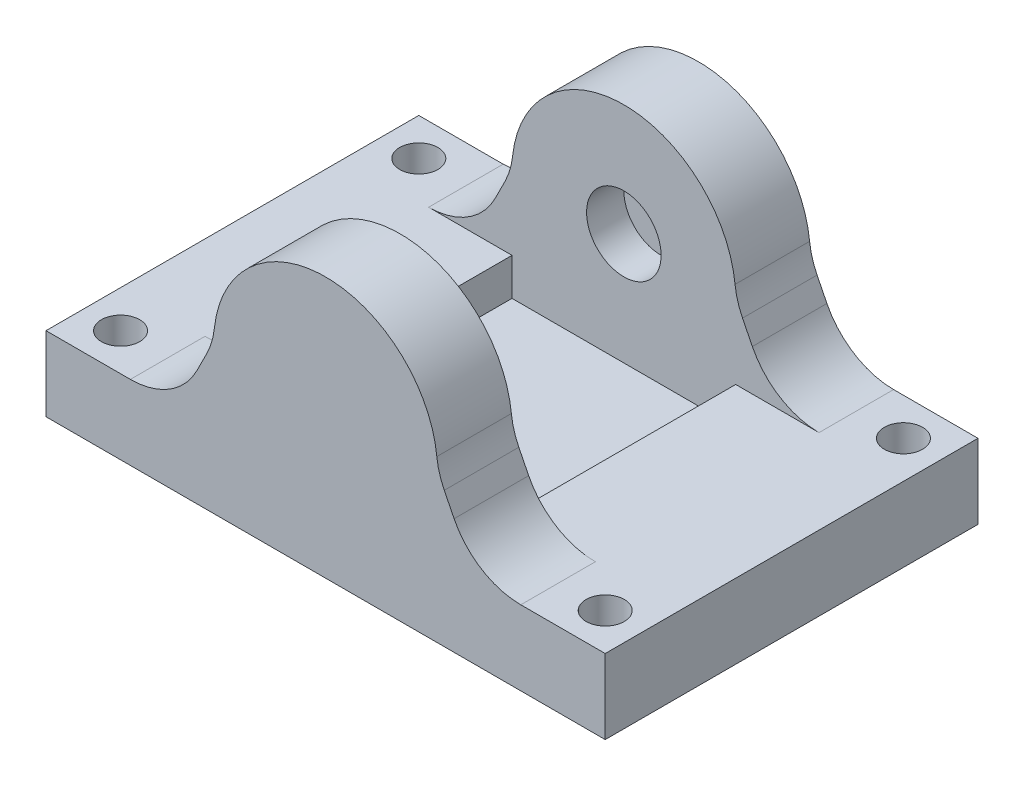
ISO-10303-21;
HEADER;
FILE_DESCRIPTION(('STEP AP214'),'2;1');
FILE_NAME('part.step','',(''),(''),'','','');
FILE_SCHEMA(('AUTOMOTIVE_DESIGN { 1 0 10303 214 1 1 1 1 }'));
ENDSEC;
DATA;
#1=APPLICATION_CONTEXT('core data for automotive mechanical design processes');
#2=APPLICATION_PROTOCOL_DEFINITION('international standard','automotive_design',2000,#1);
#3=PRODUCT_CONTEXT('',#1,'mechanical');
#4=PRODUCT('Part','Part','',(#3));
#5=PRODUCT_RELATED_PRODUCT_CATEGORY('part','',(#4));
#6=PRODUCT_DEFINITION_FORMATION('','',#4);
#7=PRODUCT_DEFINITION_CONTEXT('part definition',#1,'design');
#8=PRODUCT_DEFINITION('design','',#6,#7);
#9=PRODUCT_DEFINITION_SHAPE('','',#8);
#10=(LENGTH_UNIT() NAMED_UNIT(*) SI_UNIT(.MILLI.,.METRE.));
#11=(NAMED_UNIT(*) PLANE_ANGLE_UNIT() SI_UNIT($,.RADIAN.));
#12=(NAMED_UNIT(*) SI_UNIT($,.STERADIAN.) SOLID_ANGLE_UNIT());
#13=UNCERTAINTY_MEASURE_WITH_UNIT(LENGTH_MEASURE(1.E-05),#10,'distance_accuracy_value','');
#14=(GEOMETRIC_REPRESENTATION_CONTEXT(3) GLOBAL_UNCERTAINTY_ASSIGNED_CONTEXT((#13)) GLOBAL_UNIT_ASSIGNED_CONTEXT((#10,
#11,#12)) REPRESENTATION_CONTEXT('',''));
#15=CARTESIAN_POINT('',(0.,0.,0.));
#16=DIRECTION('',(0.,0.,1.));
#17=DIRECTION('',(1.,0.,0.));
#18=AXIS2_PLACEMENT_3D('',#15,#16,#17);
#19=CARTESIAN_POINT('',(0.,10.,0.));
#20=DIRECTION('',(0.,1.,0.));
#21=DIRECTION('',(0.,0.,1.));
#22=AXIS2_PLACEMENT_3D('',#19,#20,#21);
#23=PLANE('',#22);
#24=DIRECTION('',(0.,0.,1.));
#25=VECTOR('',#24,1.);
#26=CARTESIAN_POINT('',(22.5,10.,-40.));
#27=LINE('',#26,#25);
#28=CARTESIAN_POINT('',(22.5,10.,-40.));
#29=VERTEX_POINT('',#28);
#30=CARTESIAN_POINT('',(22.5,10.,-10.));
#31=VERTEX_POINT('',#30);
#32=EDGE_CURVE('E209',#29,#31,#27,.T.);
#33=ORIENTED_EDGE('',*,*,#32,.F.);
#34=DIRECTION('',(1.,0.,0.));
#35=VECTOR('',#34,1.);
#36=CARTESIAN_POINT('',(17.5,10.,-40.));
#37=LINE('',#36,#35);
#38=CARTESIAN_POINT('',(11.319660112501,10.,-40.));
#39=VERTEX_POINT('',#38);
#40=EDGE_CURVE('E280',#39,#29,#37,.T.);
#41=ORIENTED_EDGE('',*,*,#40,.F.);
#42=DIRECTION('',(0.,0.,-1.));
#43=VECTOR('',#42,1.);
#44=CARTESIAN_POINT('',(11.319660112501,10.,0.));
#45=LINE('',#44,#43);
#46=CARTESIAN_POINT('',(11.319660112501,10.,-50.));
#47=VERTEX_POINT('',#46);
#48=EDGE_CURVE('E395',#39,#47,#45,.T.);
#49=ORIENTED_EDGE('',*,*,#48,.T.);
#50=DIRECTION('',(1.,0.,0.));
#51=VECTOR('',#50,1.);
#52=CARTESIAN_POINT('',(0.,10.,-50.));
#53=LINE('',#52,#51);
#54=CARTESIAN_POINT('',(0.,10.,-50.));
#55=VERTEX_POINT('',#54);
#56=EDGE_CURVE('E328',#55,#47,#53,.T.);
#57=ORIENTED_EDGE('',*,*,#56,.F.);
#58=DIRECTION('',(0.,0.,-1.));
#59=VECTOR('',#58,1.);
#60=CARTESIAN_POINT('',(0.,10.,0.));
#61=LINE('',#60,#59);
#62=CARTESIAN_POINT('',(0.,10.,0.));
#63=VERTEX_POINT('',#62);
#64=EDGE_CURVE('E331',#63,#55,#61,.T.);
#65=ORIENTED_EDGE('',*,*,#64,.F.);
#66=DIRECTION('',(1.,0.,0.));
#67=VECTOR('',#66,1.);
#68=CARTESIAN_POINT('',(0.,10.,0.));
#69=LINE('',#68,#67);
#70=CARTESIAN_POINT('',(11.319660112501,10.,0.));
#71=VERTEX_POINT('',#70);
#72=EDGE_CURVE('E320',#63,#71,#69,.T.);
#73=ORIENTED_EDGE('',*,*,#72,.T.);
#74=DIRECTION('',(0.,0.,1.));
#75=VECTOR('',#74,1.);
#76=CARTESIAN_POINT('',(11.319660112501,10.,-10.));
#77=LINE('',#76,#75);
#78=CARTESIAN_POINT('',(11.319660112501,10.,-10.));
#79=VERTEX_POINT('',#78);
#80=EDGE_CURVE('E362',#71,#79,#77,.F.);
#81=ORIENTED_EDGE('',*,*,#80,.T.);
#82=DIRECTION('',(1.,0.,0.));
#83=VECTOR('',#82,1.);
#84=CARTESIAN_POINT('',(17.5,10.,-10.));
#85=LINE('',#84,#83);
#86=EDGE_CURVE('E307',#79,#31,#85,.T.);
#87=ORIENTED_EDGE('',*,*,#86,.T.);
#88=EDGE_LOOP('',(#33,#41,#49,#57,#65,#73,#81,#87));
#89=FACE_BOUND('',#88,.T.);
#90=CARTESIAN_POINT('',(5.,10.,-5.));
#91=DIRECTION('',(0.,1.,0.));
#92=DIRECTION('',(0.,0.,1.));
#93=AXIS2_PLACEMENT_3D('',#90,#91,#92);
#94=CIRCLE('',#93,2.5625);
#95=CARTESIAN_POINT('',(5.,10.,-2.4375));
#96=VERTEX_POINT('',#95);
#97=EDGE_CURVE('E258',#96,#96,#94,.T.);
#98=ORIENTED_EDGE('',*,*,#97,.F.);
#99=EDGE_LOOP('',(#98));
#100=FACE_BOUND('',#99,.T.);
#101=CARTESIAN_POINT('',(5.,10.,-45.));
#102=DIRECTION('',(0.,-1.,0.));
#103=DIRECTION('',(0.,0.,-1.));
#104=AXIS2_PLACEMENT_3D('',#101,#102,#103);
#105=CIRCLE('',#104,2.5625);
#106=CARTESIAN_POINT('',(5.,10.,-47.5625));
#107=VERTEX_POINT('',#106);
#108=EDGE_CURVE('E252',#107,#107,#105,.T.);
#109=ORIENTED_EDGE('',*,*,#108,.T.);
#110=EDGE_LOOP('',(#109));
#111=FACE_BOUND('',#110,.T.);
#112=ADVANCED_FACE('F40',(#89,#100,#111),#23,.T.);
#113=DIRECTION('',(0.,0.,-1.));
#114=VECTOR('',#113,1.);
#115=CARTESIAN_POINT('',(52.5,10.,-40.));
#116=LINE('',#115,#114);
#117=CARTESIAN_POINT('',(52.5,10.,-10.));
#118=VERTEX_POINT('',#117);
#119=CARTESIAN_POINT('',(52.5,10.,-40.));
#120=VERTEX_POINT('',#119);
#121=EDGE_CURVE('E55',#118,#120,#116,.T.);
#122=ORIENTED_EDGE('',*,*,#121,.F.);
#123=CARTESIAN_POINT('',(63.680339887499,10.,-10.));
#124=VERTEX_POINT('',#123);
#125=EDGE_CURVE('E306',#118,#124,#85,.T.);
#126=ORIENTED_EDGE('',*,*,#125,.T.);
#127=DIRECTION('',(0.,0.,1.));
#128=VECTOR('',#127,1.);
#129=CARTESIAN_POINT('',(63.680339887499,10.,0.));
#130=LINE('',#129,#128);
#131=CARTESIAN_POINT('',(63.680339887499,10.,0.));
#132=VERTEX_POINT('',#131);
#133=EDGE_CURVE('E359',#124,#132,#130,.T.);
#134=ORIENTED_EDGE('',*,*,#133,.T.);
#135=CARTESIAN_POINT('',(75.,10.,0.));
#136=VERTEX_POINT('',#135);
#137=EDGE_CURVE('E324',#132,#136,#69,.T.);
#138=ORIENTED_EDGE('',*,*,#137,.T.);
#139=DIRECTION('',(0.,0.,-1.));
#140=VECTOR('',#139,1.);
#141=CARTESIAN_POINT('',(75.,10.,0.));
#142=LINE('',#141,#140);
#143=CARTESIAN_POINT('',(75.,10.,-50.));
#144=VERTEX_POINT('',#143);
#145=EDGE_CURVE('E323',#136,#144,#142,.T.);
#146=ORIENTED_EDGE('',*,*,#145,.T.);
#147=CARTESIAN_POINT('',(63.6803398874989,10.,-50.));
#148=VERTEX_POINT('',#147);
#149=EDGE_CURVE('E327',#148,#144,#53,.T.);
#150=ORIENTED_EDGE('',*,*,#149,.F.);
#151=DIRECTION('',(0.,0.,-1.));
#152=VECTOR('',#151,1.);
#153=CARTESIAN_POINT('',(63.6803398874989,10.,0.));
#154=LINE('',#153,#152);
#155=CARTESIAN_POINT('',(63.6803398874989,10.,-40.));
#156=VERTEX_POINT('',#155);
#157=EDGE_CURVE('E392',#148,#156,#154,.F.);
#158=ORIENTED_EDGE('',*,*,#157,.T.);
#159=EDGE_CURVE('E279',#120,#156,#37,.T.);
#160=ORIENTED_EDGE('',*,*,#159,.F.);
#161=EDGE_LOOP('',(#122,#126,#134,#138,#146,#150,#158,#160));
#162=FACE_BOUND('',#161,.T.);
#163=CARTESIAN_POINT('',(70.,10.,-45.));
#164=DIRECTION('',(0.,1.,0.));
#165=DIRECTION('',(0.,0.,-1.));
#166=AXIS2_PLACEMENT_3D('',#163,#164,#165);
#167=CIRCLE('',#166,2.5625);
#168=CARTESIAN_POINT('',(70.,10.,-47.5625));
#169=VERTEX_POINT('',#168);
#170=EDGE_CURVE('E237',#169,#169,#167,.T.);
#171=ORIENTED_EDGE('',*,*,#170,.F.);
#172=EDGE_LOOP('',(#171));
#173=FACE_BOUND('',#172,.T.);
#174=CARTESIAN_POINT('',(70.,10.,-5.));
#175=DIRECTION('',(0.,-1.,0.));
#176=DIRECTION('',(0.,0.,1.));
#177=AXIS2_PLACEMENT_3D('',#174,#175,#176);
#178=CIRCLE('',#177,2.5625);
#179=CARTESIAN_POINT('',(70.,10.,-2.4375));
#180=VERTEX_POINT('',#179);
#181=EDGE_CURVE('E246',#180,#180,#178,.T.);
#182=ORIENTED_EDGE('',*,*,#181,.T.);
#183=EDGE_LOOP('',(#182));
#184=FACE_BOUND('',#183,.T.);
#185=ADVANCED_FACE('F485',(#162,#173,#184),#23,.T.);
#186=CARTESIAN_POINT('',(0.,10.,0.));
#187=DIRECTION('',(0.,0.,-1.));
#188=DIRECTION('',(-1.,0.,0.));
#189=AXIS2_PLACEMENT_3D('',#186,#187,#188);
#190=PLANE('',#189);
#191=DIRECTION('',(1.,0.,0.));
#192=VECTOR('',#191,1.);
#193=CARTESIAN_POINT('',(0.,0.,0.));
#194=LINE('',#193,#192);
#195=CARTESIAN_POINT('',(0.,0.,0.));
#196=VERTEX_POINT('',#195);
#197=CARTESIAN_POINT('',(75.,0.,0.));
#198=VERTEX_POINT('',#197);
#199=EDGE_CURVE('E312',#196,#198,#194,.T.);
#200=ORIENTED_EDGE('',*,*,#199,.T.);
#201=DIRECTION('',(0.,-1.,0.));
#202=VECTOR('',#201,1.);
#203=CARTESIAN_POINT('',(75.,10.,0.));
#204=LINE('',#203,#202);
#205=EDGE_CURVE('E351',#136,#198,#204,.T.);
#206=ORIENTED_EDGE('',*,*,#205,.F.);
#207=ORIENTED_EDGE('',*,*,#137,.F.);
#208=CARTESIAN_POINT('',(63.680339887499,20.,0.));
#209=DIRECTION('',(0.,0.,-1.));
#210=DIRECTION('',(-1.,0.,0.));
#211=AXIS2_PLACEMENT_3D('',#208,#209,#210);
#212=CIRCLE('',#211,10.);
#213=CARTESIAN_POINT('',(54.7360679774998,15.5278640450004,0.));
#214=VERTEX_POINT('',#213);
#215=EDGE_CURVE('E379',#132,#214,#212,.T.);
#216=ORIENTED_EDGE('',*,*,#215,.T.);
#217=DIRECTION('',(-0.447213595499958,0.894427190999916,0.));
#218=VECTOR('',#217,1.);
#219=CARTESIAN_POINT('',(52.5,20.,0.));
#220=LINE('',#219,#218);
#221=CARTESIAN_POINT('',(53.4159122232253,18.1681755535495,0.));
#222=VERTEX_POINT('',#221);
#223=EDGE_CURVE('E303',#214,#222,#220,.T.);
#224=ORIENTED_EDGE('',*,*,#223,.T.);
#225=CARTESIAN_POINT('',(62.3601841332244,22.640311508549,0.));
#226=DIRECTION('',(0.,0.,-1.));
#227=DIRECTION('',(-1.,0.,0.));
#228=AXIS2_PLACEMENT_3D('',#225,#226,#227);
#229=CIRCLE('',#228,10.);
#230=CARTESIAN_POINT('',(52.4161104799347,21.5841869051294,0.));
#231=VERTEX_POINT('',#230);
#232=EDGE_CURVE('E388',#222,#231,#229,.T.);
#233=ORIENTED_EDGE('',*,*,#232,.T.);
#234=CARTESIAN_POINT('',(37.5,20.,0.));
#235=DIRECTION('',(0.,0.,1.));
#236=DIRECTION('',(1.,0.,0.));
#237=AXIS2_PLACEMENT_3D('',#234,#235,#236);
#238=CIRCLE('',#237,15.);
#239=CARTESIAN_POINT('',(22.5838895200653,21.5841869051294,0.));
#240=VERTEX_POINT('',#239);
#241=EDGE_CURVE('E296',#231,#240,#238,.T.);
#242=ORIENTED_EDGE('',*,*,#241,.T.);
#243=CARTESIAN_POINT('',(12.6398158667756,22.6403115085491,0.));
#244=DIRECTION('',(0.,0.,-1.));
#245=DIRECTION('',(-1.,0.,0.));
#246=AXIS2_PLACEMENT_3D('',#243,#244,#245);
#247=CIRCLE('',#246,10.);
#248=CARTESIAN_POINT('',(21.5840877767747,18.1681755535495,0.));
#249=VERTEX_POINT('',#248);
#250=EDGE_CURVE('E384',#240,#249,#247,.T.);
#251=ORIENTED_EDGE('',*,*,#250,.T.);
#252=DIRECTION('',(-0.447213595499958,-0.894427190999916,0.));
#253=VECTOR('',#252,1.);
#254=CARTESIAN_POINT('',(22.5,20.,0.));
#255=LINE('',#254,#253);
#256=CARTESIAN_POINT('',(20.2639320225002,15.5278640450004,0.));
#257=VERTEX_POINT('',#256);
#258=EDGE_CURVE('E315',#249,#257,#255,.T.);
#259=ORIENTED_EDGE('',*,*,#258,.T.);
#260=CARTESIAN_POINT('',(11.319660112501,20.,0.));
#261=DIRECTION('',(0.,0.,-1.));
#262=DIRECTION('',(-1.,0.,0.));
#263=AXIS2_PLACEMENT_3D('',#260,#261,#262);
#264=CIRCLE('',#263,10.);
#265=EDGE_CURVE('E375',#257,#71,#264,.T.);
#266=ORIENTED_EDGE('',*,*,#265,.T.);
#267=ORIENTED_EDGE('',*,*,#72,.F.);
#268=DIRECTION('',(0.,-1.,0.));
#269=VECTOR('',#268,1.);
#270=CARTESIAN_POINT('',(0.,10.,0.));
#271=LINE('',#270,#269);
#272=EDGE_CURVE('E334',#63,#196,#271,.T.);
#273=ORIENTED_EDGE('',*,*,#272,.T.);
#274=EDGE_LOOP('',(#200,#206,#207,#216,#224,#233,#242,#251,#259,#266,#267,#273));
#275=FACE_BOUND('',#274,.T.);
#276=ADVANCED_FACE('F469',(#275),#190,.F.);
#277=CARTESIAN_POINT('',(75.,10.,0.));
#278=DIRECTION('',(-1.,0.,0.));
#279=DIRECTION('',(0.,0.,1.));
#280=AXIS2_PLACEMENT_3D('',#277,#278,#279);
#281=PLANE('',#280);
#282=DIRECTION('',(0.,0.,-1.));
#283=VECTOR('',#282,1.);
#284=CARTESIAN_POINT('',(75.,0.,0.));
#285=LINE('',#284,#283);
#286=CARTESIAN_POINT('',(75.,0.,-50.));
#287=VERTEX_POINT('',#286);
#288=EDGE_CURVE('E337',#198,#287,#285,.T.);
#289=ORIENTED_EDGE('',*,*,#288,.T.);
#290=DIRECTION('',(0.,-1.,0.));
#291=VECTOR('',#290,1.);
#292=CARTESIAN_POINT('',(75.,10.,-50.));
#293=LINE('',#292,#291);
#294=EDGE_CURVE('E349',#144,#287,#293,.T.);
#295=ORIENTED_EDGE('',*,*,#294,.F.);
#296=ORIENTED_EDGE('',*,*,#145,.F.);
#297=ORIENTED_EDGE('',*,*,#205,.T.);
#298=EDGE_LOOP('',(#289,#295,#296,#297));
#299=FACE_BOUND('',#298,.T.);
#300=ADVANCED_FACE('F481',(#299),#281,.F.);
#301=CARTESIAN_POINT('',(0.,10.,-50.));
#302=DIRECTION('',(0.,0.,-1.));
#303=DIRECTION('',(-1.,0.,0.));
#304=AXIS2_PLACEMENT_3D('',#301,#302,#303);
#305=PLANE('',#304);
#306=DIRECTION('',(1.,0.,0.));
#307=VECTOR('',#306,1.);
#308=CARTESIAN_POINT('',(0.,0.,-50.));
#309=LINE('',#308,#307);
#310=CARTESIAN_POINT('',(0.,0.,-50.));
#311=VERTEX_POINT('',#310);
#312=EDGE_CURVE('E340',#311,#287,#309,.T.);
#313=ORIENTED_EDGE('',*,*,#312,.F.);
#314=DIRECTION('',(0.,-1.,0.));
#315=VECTOR('',#314,1.);
#316=CARTESIAN_POINT('',(0.,10.,-50.));
#317=LINE('',#316,#315);
#318=EDGE_CURVE('E347',#55,#311,#317,.T.);
#319=ORIENTED_EDGE('',*,*,#318,.F.);
#320=ORIENTED_EDGE('',*,*,#56,.T.);
#321=CARTESIAN_POINT('',(11.319660112501,20.,-50.));
#322=DIRECTION('',(0.,0.,-1.));
#323=DIRECTION('',(-1.,0.,0.));
#324=AXIS2_PLACEMENT_3D('',#321,#322,#323);
#325=CIRCLE('',#324,10.);
#326=CARTESIAN_POINT('',(20.2639320225002,15.5278640450004,-50.));
#327=VERTEX_POINT('',#326);
#328=EDGE_CURVE('E412',#47,#327,#325,.F.);
#329=ORIENTED_EDGE('',*,*,#328,.T.);
#330=DIRECTION('',(-0.447213595499958,-0.894427190999916,0.));
#331=VECTOR('',#330,1.);
#332=CARTESIAN_POINT('',(22.5,20.,-50.));
#333=LINE('',#332,#331);
#334=CARTESIAN_POINT('',(21.5840877767747,18.1681755535495,-50.));
#335=VERTEX_POINT('',#334);
#336=EDGE_CURVE('E276',#335,#327,#333,.T.);
#337=ORIENTED_EDGE('',*,*,#336,.F.);
#338=CARTESIAN_POINT('',(12.6398158667756,22.6403115085491,-50.));
#339=DIRECTION('',(0.,0.,-1.));
#340=DIRECTION('',(-1.,0.,0.));
#341=AXIS2_PLACEMENT_3D('',#338,#339,#340);
#342=CIRCLE('',#341,10.);
#343=CARTESIAN_POINT('',(22.5838895200653,21.5841869051294,-50.));
#344=VERTEX_POINT('',#343);
#345=EDGE_CURVE('E421',#335,#344,#342,.F.);
#346=ORIENTED_EDGE('',*,*,#345,.T.);
#347=CARTESIAN_POINT('',(37.5,20.,-50.));
#348=DIRECTION('',(0.,0.,1.));
#349=DIRECTION('',(1.,0.,0.));
#350=AXIS2_PLACEMENT_3D('',#347,#348,#349);
#351=CIRCLE('',#350,15.);
#352=CARTESIAN_POINT('',(52.4161104799347,21.5841869051294,-50.));
#353=VERTEX_POINT('',#352);
#354=EDGE_CURVE('E270',#353,#344,#351,.T.);
#355=ORIENTED_EDGE('',*,*,#354,.F.);
#356=CARTESIAN_POINT('',(62.3601841332244,22.640311508549,-50.));
#357=DIRECTION('',(0.,0.,-1.));
#358=DIRECTION('',(-1.,0.,0.));
#359=AXIS2_PLACEMENT_3D('',#356,#357,#358);
#360=CIRCLE('',#359,10.);
#361=CARTESIAN_POINT('',(53.4159122232253,18.1681755535495,-50.));
#362=VERTEX_POINT('',#361);
#363=EDGE_CURVE('E48',#353,#362,#360,.F.);
#364=ORIENTED_EDGE('',*,*,#363,.T.);
#365=DIRECTION('',(-0.447213595499958,0.894427190999916,0.));
#366=VECTOR('',#365,1.);
#367=CARTESIAN_POINT('',(52.5,20.,-50.));
#368=LINE('',#367,#366);
#369=CARTESIAN_POINT('',(54.7360679774998,15.5278640450004,-50.));
#370=VERTEX_POINT('',#369);
#371=EDGE_CURVE('E288',#370,#362,#368,.T.);
#372=ORIENTED_EDGE('',*,*,#371,.F.);
#373=CARTESIAN_POINT('',(63.6803398874989,20.,-50.));
#374=DIRECTION('',(0.,0.,-1.));
#375=DIRECTION('',(-1.,0.,0.));
#376=AXIS2_PLACEMENT_3D('',#373,#374,#375);
#377=CIRCLE('',#376,10.);
#378=EDGE_CURVE('E417',#370,#148,#377,.F.);
#379=ORIENTED_EDGE('',*,*,#378,.T.);
#380=ORIENTED_EDGE('',*,*,#149,.T.);
#381=ORIENTED_EDGE('',*,*,#294,.T.);
#382=EDGE_LOOP('',(#313,#319,#320,#329,#337,#346,#355,#364,#372,#379,#380,#381));
#383=FACE_BOUND('',#382,.T.);
#384=ADVANCED_FACE('F428',(#383),#305,.T.);
#385=CARTESIAN_POINT('',(0.,10.,0.));
#386=DIRECTION('',(-1.,0.,0.));
#387=DIRECTION('',(0.,0.,1.));
#388=AXIS2_PLACEMENT_3D('',#385,#386,#387);
#389=PLANE('',#388);
#390=DIRECTION('',(0.,0.,-1.));
#391=VECTOR('',#390,1.);
#392=CARTESIAN_POINT('',(0.,0.,0.));
#393=LINE('',#392,#391);
#394=EDGE_CURVE('E343',#196,#311,#393,.T.);
#395=ORIENTED_EDGE('',*,*,#394,.F.);
#396=ORIENTED_EDGE('',*,*,#272,.F.);
#397=ORIENTED_EDGE('',*,*,#64,.T.);
#398=ORIENTED_EDGE('',*,*,#318,.T.);
#399=EDGE_LOOP('',(#395,#396,#397,#398));
#400=FACE_BOUND('',#399,.T.);
#401=ADVANCED_FACE('F473',(#400),#389,.T.);
#402=CARTESIAN_POINT('',(0.,0.,0.));
#403=DIRECTION('',(0.,1.,0.));
#404=DIRECTION('',(0.,0.,1.));
#405=AXIS2_PLACEMENT_3D('',#402,#403,#404);
#406=PLANE('',#405);
#407=CARTESIAN_POINT('',(70.,0.,-45.));
#408=DIRECTION('',(0.,1.,0.));
#409=DIRECTION('',(0.,0.,-1.));
#410=AXIS2_PLACEMENT_3D('',#407,#408,#409);
#411=CIRCLE('',#410,2.5625);
#412=CARTESIAN_POINT('',(70.,0.,-47.5625));
#413=VERTEX_POINT('',#412);
#414=EDGE_CURVE('E243',#413,#413,#411,.T.);
#415=ORIENTED_EDGE('',*,*,#414,.T.);
#416=EDGE_LOOP('',(#415));
#417=FACE_BOUND('',#416,.T.);
#418=CARTESIAN_POINT('',(70.,0.,-5.));
#419=DIRECTION('',(0.,-1.,0.));
#420=DIRECTION('',(0.,0.,1.));
#421=AXIS2_PLACEMENT_3D('',#418,#419,#420);
#422=CIRCLE('',#421,2.5625);
#423=CARTESIAN_POINT('',(70.,0.,-2.4375));
#424=VERTEX_POINT('',#423);
#425=EDGE_CURVE('E249',#424,#424,#422,.T.);
#426=ORIENTED_EDGE('',*,*,#425,.F.);
#427=EDGE_LOOP('',(#426));
#428=FACE_BOUND('',#427,.T.);
#429=CARTESIAN_POINT('',(5.,0.,-45.));
#430=DIRECTION('',(0.,-1.,0.));
#431=DIRECTION('',(0.,0.,-1.));
#432=AXIS2_PLACEMENT_3D('',#429,#430,#431);
#433=CIRCLE('',#432,2.5625);
#434=CARTESIAN_POINT('',(5.,0.,-47.5625));
#435=VERTEX_POINT('',#434);
#436=EDGE_CURVE('E255',#435,#435,#433,.T.);
#437=ORIENTED_EDGE('',*,*,#436,.F.);
#438=EDGE_LOOP('',(#437));
#439=FACE_BOUND('',#438,.T.);
#440=CARTESIAN_POINT('',(5.,0.,-5.));
#441=DIRECTION('',(0.,1.,0.));
#442=DIRECTION('',(0.,0.,1.));
#443=AXIS2_PLACEMENT_3D('',#440,#441,#442);
#444=CIRCLE('',#443,2.5625);
#445=CARTESIAN_POINT('',(5.,0.,-2.4375));
#446=VERTEX_POINT('',#445);
#447=EDGE_CURVE('E261',#446,#446,#444,.T.);
#448=ORIENTED_EDGE('',*,*,#447,.T.);
#449=EDGE_LOOP('',(#448));
#450=FACE_BOUND('',#449,.T.);
#451=ORIENTED_EDGE('',*,*,#199,.F.);
#452=ORIENTED_EDGE('',*,*,#394,.T.);
#453=ORIENTED_EDGE('',*,*,#312,.T.);
#454=ORIENTED_EDGE('',*,*,#288,.F.);
#455=EDGE_LOOP('',(#451,#452,#453,#454));
#456=FACE_BOUND('',#455,.T.);
#457=ADVANCED_FACE('F477',(#417,#428,#439,#450,#456),#406,.F.);
#458=CARTESIAN_POINT('',(37.5,20.,-10.));
#459=DIRECTION('',(0.,0.,1.));
#460=DIRECTION('',(1.,0.,0.));
#461=AXIS2_PLACEMENT_3D('',#458,#459,#460);
#462=CYLINDRICAL_SURFACE('',#461,15.);
#463=CARTESIAN_POINT('',(37.5,20.,-10.));
#464=DIRECTION('',(0.,0.,1.));
#465=DIRECTION('',(1.,0.,0.));
#466=AXIS2_PLACEMENT_3D('',#463,#464,#465);
#467=CIRCLE('',#466,15.);
#468=CARTESIAN_POINT('',(52.4161104799347,21.5841869051294,-10.));
#469=VERTEX_POINT('',#468);
#470=CARTESIAN_POINT('',(22.5838895200653,21.5841869051294,-10.));
#471=VERTEX_POINT('',#470);
#472=EDGE_CURVE('E299',#469,#471,#467,.T.);
#473=ORIENTED_EDGE('',*,*,#472,.T.);
#474=DIRECTION('',(0.,0.,1.));
#475=VECTOR('',#474,1.);
#476=CARTESIAN_POINT('',(22.5838895200653,21.5841869051294,-10.));
#477=LINE('',#476,#475);
#478=EDGE_CURVE('E372',#471,#240,#477,.T.);
#479=ORIENTED_EDGE('',*,*,#478,.T.);
#480=ORIENTED_EDGE('',*,*,#241,.F.);
#481=DIRECTION('',(0.,0.,1.));
#482=VECTOR('',#481,1.);
#483=CARTESIAN_POINT('',(52.4161104799347,21.5841869051294,-10.));
#484=LINE('',#483,#482);
#485=EDGE_CURVE('E370',#231,#469,#484,.F.);
#486=ORIENTED_EDGE('',*,*,#485,.T.);
#487=EDGE_LOOP('',(#473,#479,#480,#486));
#488=FACE_BOUND('',#487,.T.);
#489=ADVANCED_FACE('F503',(#488),#462,.T.);
#490=CARTESIAN_POINT('',(52.5,20.,-10.));
#491=DIRECTION('',(0.894427190999916,0.447213595499958,0.));
#492=DIRECTION('',(-0.447213595499958,0.894427190999916,0.));
#493=AXIS2_PLACEMENT_3D('',#490,#491,#492);
#494=PLANE('',#493);
#495=ORIENTED_EDGE('',*,*,#223,.F.);
#496=DIRECTION('',(0.,0.,1.));
#497=VECTOR('',#496,1.);
#498=CARTESIAN_POINT('',(54.7360679774998,15.5278640450004,-10.));
#499=LINE('',#498,#497);
#500=CARTESIAN_POINT('',(54.7360679774998,15.5278640450004,-10.));
#501=VERTEX_POINT('',#500);
#502=EDGE_CURVE('E368',#214,#501,#499,.F.);
#503=ORIENTED_EDGE('',*,*,#502,.T.);
#504=DIRECTION('',(-0.447213595499958,0.894427190999916,0.));
#505=VECTOR('',#504,1.);
#506=CARTESIAN_POINT('',(52.5,20.,-10.));
#507=LINE('',#506,#505);
#508=CARTESIAN_POINT('',(53.4159122232253,18.1681755535495,-10.));
#509=VERTEX_POINT('',#508);
#510=EDGE_CURVE('E309',#501,#509,#507,.T.);
#511=ORIENTED_EDGE('',*,*,#510,.T.);
#512=DIRECTION('',(0.,0.,-1.));
#513=VECTOR('',#512,1.);
#514=CARTESIAN_POINT('',(53.4159122232253,18.1681755535495,0.));
#515=LINE('',#514,#513);
#516=EDGE_CURVE('E365',#509,#222,#515,.F.);
#517=ORIENTED_EDGE('',*,*,#516,.T.);
#518=EDGE_LOOP('',(#495,#503,#511,#517));
#519=FACE_BOUND('',#518,.T.);
#520=ADVANCED_FACE('F495',(#519),#494,.T.);
#521=CARTESIAN_POINT('',(22.5,20.,-10.));
#522=DIRECTION('',(-0.894427190999916,0.447213595499958,0.));
#523=DIRECTION('',(-0.447213595499958,-0.894427190999916,0.));
#524=AXIS2_PLACEMENT_3D('',#521,#522,#523);
#525=PLANE('',#524);
#526=DIRECTION('',(-0.447213595499958,-0.894427190999916,0.));
#527=VECTOR('',#526,1.);
#528=CARTESIAN_POINT('',(22.5,20.,-10.));
#529=LINE('',#528,#527);
#530=CARTESIAN_POINT('',(21.5840877767747,18.1681755535495,-10.));
#531=VERTEX_POINT('',#530);
#532=CARTESIAN_POINT('',(20.2639320225002,15.5278640450004,-10.));
#533=VERTEX_POINT('',#532);
#534=EDGE_CURVE('E302',#531,#533,#529,.T.);
#535=ORIENTED_EDGE('',*,*,#534,.T.);
#536=DIRECTION('',(0.,0.,1.));
#537=VECTOR('',#536,1.);
#538=CARTESIAN_POINT('',(20.2639320225002,15.5278640450004,0.));
#539=LINE('',#538,#537);
#540=EDGE_CURVE('E356',#533,#257,#539,.T.);
#541=ORIENTED_EDGE('',*,*,#540,.T.);
#542=ORIENTED_EDGE('',*,*,#258,.F.);
#543=DIRECTION('',(0.,0.,-1.));
#544=VECTOR('',#543,1.);
#545=CARTESIAN_POINT('',(21.5840877767747,18.1681755535495,-10.));
#546=LINE('',#545,#544);
#547=EDGE_CURVE('E354',#249,#531,#546,.T.);
#548=ORIENTED_EDGE('',*,*,#547,.T.);
#549=EDGE_LOOP('',(#535,#541,#542,#548));
#550=FACE_BOUND('',#549,.T.);
#551=ADVANCED_FACE('F463',(#550),#525,.T.);
#552=CARTESIAN_POINT('',(37.5,20.,-10.));
#553=DIRECTION('',(0.,0.,1.));
#554=DIRECTION('',(1.,0.,0.));
#555=AXIS2_PLACEMENT_3D('',#552,#553,#554);
#556=PLANE('',#555);
#557=CARTESIAN_POINT('',(37.5,20.,-10.));
#558=DIRECTION('',(0.,0.,-1.));
#559=DIRECTION('',(-1.,0.,0.));
#560=AXIS2_PLACEMENT_3D('',#557,#558,#559);
#561=CIRCLE('',#560,5.);
#562=CARTESIAN_POINT('',(32.5,20.,-10.));
#563=VERTEX_POINT('',#562);
#564=EDGE_CURVE('E286',#563,#563,#561,.T.);
#565=ORIENTED_EDGE('',*,*,#564,.F.);
#566=EDGE_LOOP('',(#565));
#567=FACE_BOUND('',#566,.T.);
#568=ORIENTED_EDGE('',*,*,#472,.F.);
#569=CARTESIAN_POINT('',(62.3601841332244,22.640311508549,-10.));
#570=DIRECTION('',(0.,0.,1.));
#571=DIRECTION('',(1.,0.,0.));
#572=AXIS2_PLACEMENT_3D('',#569,#570,#571);
#573=CIRCLE('',#572,10.);
#574=EDGE_CURVE('E390',#469,#509,#573,.T.);
#575=ORIENTED_EDGE('',*,*,#574,.T.);
#576=ORIENTED_EDGE('',*,*,#510,.F.);
#577=CARTESIAN_POINT('',(63.680339887499,20.,-10.));
#578=DIRECTION('',(0.,0.,1.));
#579=DIRECTION('',(1.,0.,0.));
#580=AXIS2_PLACEMENT_3D('',#577,#578,#579);
#581=CIRCLE('',#580,10.);
#582=EDGE_CURVE('E381',#501,#124,#581,.T.);
#583=ORIENTED_EDGE('',*,*,#582,.T.);
#584=ORIENTED_EDGE('',*,*,#125,.F.);
#585=DIRECTION('',(0.,1.,0.));
#586=VECTOR('',#585,1.);
#587=CARTESIAN_POINT('',(52.5,5.,-10.));
#588=LINE('',#587,#586);
#589=CARTESIAN_POINT('',(52.5,5.,-10.));
#590=VERTEX_POINT('',#589);
#591=EDGE_CURVE('E213',#590,#118,#588,.T.);
#592=ORIENTED_EDGE('',*,*,#591,.F.);
#593=DIRECTION('',(1.,0.,0.));
#594=VECTOR('',#593,1.);
#595=CARTESIAN_POINT('',(22.5,5.,-10.));
#596=LINE('',#595,#594);
#597=CARTESIAN_POINT('',(22.5,5.,-10.));
#598=VERTEX_POINT('',#597);
#599=EDGE_CURVE('E217',#598,#590,#596,.T.);
#600=ORIENTED_EDGE('',*,*,#599,.F.);
#601=DIRECTION('',(0.,1.,0.));
#602=VECTOR('',#601,1.);
#603=CARTESIAN_POINT('',(22.5,5.,-10.));
#604=LINE('',#603,#602);
#605=EDGE_CURVE('E202',#598,#31,#604,.T.);
#606=ORIENTED_EDGE('',*,*,#605,.T.);
#607=ORIENTED_EDGE('',*,*,#86,.F.);
#608=CARTESIAN_POINT('',(11.319660112501,20.,-10.));
#609=DIRECTION('',(0.,0.,1.));
#610=DIRECTION('',(1.,0.,0.));
#611=AXIS2_PLACEMENT_3D('',#608,#609,#610);
#612=CIRCLE('',#611,10.);
#613=EDGE_CURVE('E377',#79,#533,#612,.T.);
#614=ORIENTED_EDGE('',*,*,#613,.T.);
#615=ORIENTED_EDGE('',*,*,#534,.F.);
#616=CARTESIAN_POINT('',(12.6398158667756,22.6403115085491,-10.));
#617=DIRECTION('',(0.,0.,1.));
#618=DIRECTION('',(1.,0.,0.));
#619=AXIS2_PLACEMENT_3D('',#616,#617,#618);
#620=CIRCLE('',#619,10.);
#621=EDGE_CURVE('E386',#531,#471,#620,.T.);
#622=ORIENTED_EDGE('',*,*,#621,.T.);
#623=EDGE_LOOP('',(#568,#575,#576,#583,#584,#592,#600,#606,#607,#614,#615,#622));
#624=FACE_BOUND('',#623,.T.);
#625=ADVANCED_FACE('F219',(#567,#624),#556,.F.);
#626=CARTESIAN_POINT('',(11.319660112501,20.,-10.));
#627=DIRECTION('',(0.,0.,-1.));
#628=DIRECTION('',(-1.,0.,0.));
#629=AXIS2_PLACEMENT_3D('',#626,#627,#628);
#630=CYLINDRICAL_SURFACE('',#629,10.);
#631=ORIENTED_EDGE('',*,*,#613,.F.);
#632=ORIENTED_EDGE('',*,*,#80,.F.);
#633=ORIENTED_EDGE('',*,*,#265,.F.);
#634=ORIENTED_EDGE('',*,*,#540,.F.);
#635=EDGE_LOOP('',(#631,#632,#633,#634));
#636=FACE_BOUND('',#635,.T.);
#637=ADVANCED_FACE('F466',(#636),#630,.F.);
#638=CARTESIAN_POINT('',(63.680339887499,20.,0.));
#639=DIRECTION('',(0.,0.,-1.));
#640=DIRECTION('',(-1.,0.,0.));
#641=AXIS2_PLACEMENT_3D('',#638,#639,#640);
#642=CYLINDRICAL_SURFACE('',#641,10.);
#643=ORIENTED_EDGE('',*,*,#582,.F.);
#644=ORIENTED_EDGE('',*,*,#502,.F.);
#645=ORIENTED_EDGE('',*,*,#215,.F.);
#646=ORIENTED_EDGE('',*,*,#133,.F.);
#647=EDGE_LOOP('',(#643,#644,#645,#646));
#648=FACE_BOUND('',#647,.T.);
#649=ADVANCED_FACE('F491',(#648),#642,.F.);
#650=CARTESIAN_POINT('',(12.6398158667756,22.6403115085491,-10.));
#651=DIRECTION('',(0.,0.,1.));
#652=DIRECTION('',(1.,0.,0.));
#653=AXIS2_PLACEMENT_3D('',#650,#651,#652);
#654=CYLINDRICAL_SURFACE('',#653,10.);
#655=ORIENTED_EDGE('',*,*,#621,.F.);
#656=ORIENTED_EDGE('',*,*,#547,.F.);
#657=ORIENTED_EDGE('',*,*,#250,.F.);
#658=ORIENTED_EDGE('',*,*,#478,.F.);
#659=EDGE_LOOP('',(#655,#656,#657,#658));
#660=FACE_BOUND('',#659,.T.);
#661=ADVANCED_FACE('F506',(#660),#654,.F.);
#662=CARTESIAN_POINT('',(62.3601841332244,22.640311508549,-10.));
#663=DIRECTION('',(0.,0.,1.));
#664=DIRECTION('',(1.,0.,0.));
#665=AXIS2_PLACEMENT_3D('',#662,#663,#664);
#666=CYLINDRICAL_SURFACE('',#665,10.);
#667=ORIENTED_EDGE('',*,*,#574,.F.);
#668=ORIENTED_EDGE('',*,*,#485,.F.);
#669=ORIENTED_EDGE('',*,*,#232,.F.);
#670=ORIENTED_EDGE('',*,*,#516,.F.);
#671=EDGE_LOOP('',(#667,#668,#669,#670));
#672=FACE_BOUND('',#671,.T.);
#673=ADVANCED_FACE('F500',(#672),#666,.F.);
#674=CARTESIAN_POINT('',(37.5,20.,-5.));
#675=DIRECTION('',(0.,0.,-1.));
#676=DIRECTION('',(-1.,0.,0.));
#677=AXIS2_PLACEMENT_3D('',#674,#675,#676);
#678=CYLINDRICAL_SURFACE('',#677,5.);
#679=CARTESIAN_POINT('',(37.5,20.,-5.));
#680=DIRECTION('',(0.,0.,-1.));
#681=DIRECTION('',(-1.,0.,0.));
#682=AXIS2_PLACEMENT_3D('',#679,#680,#681);
#683=CIRCLE('',#682,5.);
#684=CARTESIAN_POINT('',(32.5,20.,-5.));
#685=VERTEX_POINT('',#684);
#686=EDGE_CURVE('E293',#685,#685,#683,.T.);
#687=ORIENTED_EDGE('',*,*,#686,.F.);
#688=EDGE_LOOP('',(#687));
#689=FACE_BOUND('',#688,.T.);
#690=ORIENTED_EDGE('',*,*,#564,.T.);
#691=EDGE_LOOP('',(#690));
#692=FACE_BOUND('',#691,.T.);
#693=ADVANCED_FACE('F513',(#689,#692),#678,.F.);
#694=CARTESIAN_POINT('',(37.5,20.,-5.));
#695=DIRECTION('',(0.,0.,-1.));
#696=DIRECTION('',(-1.,0.,0.));
#697=AXIS2_PLACEMENT_3D('',#694,#695,#696);
#698=PLANE('',#697);
#699=ORIENTED_EDGE('',*,*,#686,.T.);
#700=EDGE_LOOP('',(#699));
#701=FACE_BOUND('',#700,.T.);
#702=ADVANCED_FACE('F751',(#701),#698,.T.);
#703=CARTESIAN_POINT('',(37.5,20.,-40.));
#704=DIRECTION('',(0.,0.,-1.));
#705=DIRECTION('',(-1.,0.,0.));
#706=AXIS2_PLACEMENT_3D('',#703,#704,#705);
#707=CYLINDRICAL_SURFACE('',#706,15.);
#708=ORIENTED_EDGE('',*,*,#354,.T.);
#709=DIRECTION('',(0.,0.,-1.));
#710=VECTOR('',#709,1.);
#711=CARTESIAN_POINT('',(22.5838895200653,21.5841869051294,-40.));
#712=LINE('',#711,#710);
#713=CARTESIAN_POINT('',(22.5838895200653,21.5841869051294,-40.));
#714=VERTEX_POINT('',#713);
#715=EDGE_CURVE('E63',#344,#714,#712,.F.);
#716=ORIENTED_EDGE('',*,*,#715,.T.);
#717=CARTESIAN_POINT('',(37.5,20.,-40.));
#718=DIRECTION('',(0.,0.,1.));
#719=DIRECTION('',(1.,0.,0.));
#720=AXIS2_PLACEMENT_3D('',#717,#718,#719);
#721=CIRCLE('',#720,15.);
#722=CARTESIAN_POINT('',(52.4161104799347,21.5841869051294,-40.));
#723=VERTEX_POINT('',#722);
#724=EDGE_CURVE('E273',#723,#714,#721,.T.);
#725=ORIENTED_EDGE('',*,*,#724,.F.);
#726=DIRECTION('',(0.,0.,-1.));
#727=VECTOR('',#726,1.);
#728=CARTESIAN_POINT('',(52.4161104799347,21.5841869051294,-40.));
#729=LINE('',#728,#727);
#730=EDGE_CURVE('E408',#723,#353,#729,.T.);
#731=ORIENTED_EDGE('',*,*,#730,.T.);
#732=EDGE_LOOP('',(#708,#716,#725,#731));
#733=FACE_BOUND('',#732,.T.);
#734=ADVANCED_FACE('F440',(#733),#707,.T.);
#735=CARTESIAN_POINT('',(22.5,20.,-40.));
#736=DIRECTION('',(0.894427190999916,-0.447213595499958,0.));
#737=DIRECTION('',(0.447213595499958,0.894427190999916,0.));
#738=AXIS2_PLACEMENT_3D('',#735,#736,#737);
#739=PLANE('',#738);
#740=ORIENTED_EDGE('',*,*,#336,.T.);
#741=DIRECTION('',(0.,0.,-1.));
#742=VECTOR('',#741,1.);
#743=CARTESIAN_POINT('',(20.2639320225002,15.5278640450004,-40.));
#744=LINE('',#743,#742);
#745=CARTESIAN_POINT('',(20.2639320225002,15.5278640450004,-40.));
#746=VERTEX_POINT('',#745);
#747=EDGE_CURVE('E401',#327,#746,#744,.F.);
#748=ORIENTED_EDGE('',*,*,#747,.T.);
#749=DIRECTION('',(-0.447213595499958,-0.894427190999916,0.));
#750=VECTOR('',#749,1.);
#751=CARTESIAN_POINT('',(22.5,20.,-40.));
#752=LINE('',#751,#750);
#753=CARTESIAN_POINT('',(21.5840877767747,18.1681755535495,-40.));
#754=VERTEX_POINT('',#753);
#755=EDGE_CURVE('E283',#754,#746,#752,.T.);
#756=ORIENTED_EDGE('',*,*,#755,.F.);
#757=DIRECTION('',(0.,0.,1.));
#758=VECTOR('',#757,1.);
#759=CARTESIAN_POINT('',(21.5840877767747,18.1681755535495,-50.));
#760=LINE('',#759,#758);
#761=EDGE_CURVE('E398',#754,#335,#760,.F.);
#762=ORIENTED_EDGE('',*,*,#761,.T.);
#763=EDGE_LOOP('',(#740,#748,#756,#762));
#764=FACE_BOUND('',#763,.T.);
#765=ADVANCED_FACE('F447',(#764),#739,.F.);
#766=CARTESIAN_POINT('',(52.5,20.,-40.));
#767=DIRECTION('',(-0.894427190999916,-0.447213595499958,0.));
#768=DIRECTION('',(0.447213595499958,-0.894427190999916,0.));
#769=AXIS2_PLACEMENT_3D('',#766,#767,#768);
#770=PLANE('',#769);
#771=DIRECTION('',(-0.447213595499958,0.894427190999916,0.));
#772=VECTOR('',#771,1.);
#773=CARTESIAN_POINT('',(52.5,20.,-40.));
#774=LINE('',#773,#772);
#775=CARTESIAN_POINT('',(54.7360679774998,15.5278640450004,-40.));
#776=VERTEX_POINT('',#775);
#777=CARTESIAN_POINT('',(53.4159122232253,18.1681755535495,-40.));
#778=VERTEX_POINT('',#777);
#779=EDGE_CURVE('E275',#776,#778,#774,.T.);
#780=ORIENTED_EDGE('',*,*,#779,.F.);
#781=DIRECTION('',(0.,0.,-1.));
#782=VECTOR('',#781,1.);
#783=CARTESIAN_POINT('',(54.7360679774998,15.5278640450004,-40.));
#784=LINE('',#783,#782);
#785=EDGE_CURVE('E405',#776,#370,#784,.T.);
#786=ORIENTED_EDGE('',*,*,#785,.T.);
#787=ORIENTED_EDGE('',*,*,#371,.T.);
#788=DIRECTION('',(0.,0.,1.));
#789=VECTOR('',#788,1.);
#790=CARTESIAN_POINT('',(53.4159122232253,18.1681755535495,-40.));
#791=LINE('',#790,#789);
#792=EDGE_CURVE('E403',#362,#778,#791,.T.);
#793=ORIENTED_EDGE('',*,*,#792,.T.);
#794=EDGE_LOOP('',(#780,#786,#787,#793));
#795=FACE_BOUND('',#794,.T.);
#796=ADVANCED_FACE('F434',(#795),#770,.F.);
#797=CARTESIAN_POINT('',(37.5,20.,-40.));
#798=DIRECTION('',(0.,0.,-1.));
#799=DIRECTION('',(1.,0.,0.));
#800=AXIS2_PLACEMENT_3D('',#797,#798,#799);
#801=PLANE('',#800);
#802=CARTESIAN_POINT('',(37.5,20.,-40.));
#803=DIRECTION('',(0.,0.,-1.));
#804=DIRECTION('',(-1.,0.,0.));
#805=AXIS2_PLACEMENT_3D('',#802,#803,#804);
#806=CIRCLE('',#805,5.);
#807=CARTESIAN_POINT('',(32.5,20.,-40.));
#808=VERTEX_POINT('',#807);
#809=EDGE_CURVE('E264',#808,#808,#806,.T.);
#810=ORIENTED_EDGE('',*,*,#809,.T.);
#811=EDGE_LOOP('',(#810));
#812=FACE_BOUND('',#811,.T.);
#813=ORIENTED_EDGE('',*,*,#779,.T.);
#814=CARTESIAN_POINT('',(62.3601841332244,22.640311508549,-40.));
#815=DIRECTION('',(0.,0.,-1.));
#816=DIRECTION('',(-1.,0.,0.));
#817=AXIS2_PLACEMENT_3D('',#814,#815,#816);
#818=CIRCLE('',#817,10.);
#819=EDGE_CURVE('E11',#778,#723,#818,.T.);
#820=ORIENTED_EDGE('',*,*,#819,.T.);
#821=ORIENTED_EDGE('',*,*,#724,.T.);
#822=CARTESIAN_POINT('',(12.6398158667756,22.6403115085491,-40.));
#823=DIRECTION('',(0.,0.,-1.));
#824=DIRECTION('',(-1.,0.,0.));
#825=AXIS2_PLACEMENT_3D('',#822,#823,#824);
#826=CIRCLE('',#825,10.);
#827=EDGE_CURVE('E423',#714,#754,#826,.T.);
#828=ORIENTED_EDGE('',*,*,#827,.T.);
#829=ORIENTED_EDGE('',*,*,#755,.T.);
#830=CARTESIAN_POINT('',(11.319660112501,20.,-40.));
#831=DIRECTION('',(0.,0.,-1.));
#832=DIRECTION('',(-1.,0.,0.));
#833=AXIS2_PLACEMENT_3D('',#830,#831,#832);
#834=CIRCLE('',#833,10.);
#835=EDGE_CURVE('E414',#746,#39,#834,.T.);
#836=ORIENTED_EDGE('',*,*,#835,.T.);
#837=ORIENTED_EDGE('',*,*,#40,.T.);
#838=DIRECTION('',(0.,1.,0.));
#839=VECTOR('',#838,1.);
#840=CARTESIAN_POINT('',(22.5,5.,-40.));
#841=LINE('',#840,#839);
#842=CARTESIAN_POINT('',(22.5,5.,-40.));
#843=VERTEX_POINT('',#842);
#844=EDGE_CURVE('E234',#843,#29,#841,.T.);
#845=ORIENTED_EDGE('',*,*,#844,.F.);
#846=DIRECTION('',(-1.,0.,0.));
#847=VECTOR('',#846,1.);
#848=CARTESIAN_POINT('',(22.5,5.,-40.));
#849=LINE('',#848,#847);
#850=CARTESIAN_POINT('',(52.5,5.,-40.));
#851=VERTEX_POINT('',#850);
#852=EDGE_CURVE('E214',#851,#843,#849,.T.);
#853=ORIENTED_EDGE('',*,*,#852,.F.);
#854=DIRECTION('',(0.,1.,0.));
#855=VECTOR('',#854,1.);
#856=CARTESIAN_POINT('',(52.5,5.,-40.));
#857=LINE('',#856,#855);
#858=EDGE_CURVE('E238',#851,#120,#857,.T.);
#859=ORIENTED_EDGE('',*,*,#858,.T.);
#860=ORIENTED_EDGE('',*,*,#159,.T.);
#861=CARTESIAN_POINT('',(63.6803398874989,20.,-40.));
#862=DIRECTION('',(0.,0.,-1.));
#863=DIRECTION('',(-1.,0.,0.));
#864=AXIS2_PLACEMENT_3D('',#861,#862,#863);
#865=CIRCLE('',#864,10.);
#866=EDGE_CURVE('E419',#156,#776,#865,.T.);
#867=ORIENTED_EDGE('',*,*,#866,.T.);
#868=EDGE_LOOP('',(#813,#820,#821,#828,#829,#836,#837,#845,#853,#859,#860,#867));
#869=FACE_BOUND('',#868,.T.);
#870=ADVANCED_FACE('F438',(#812,#869),#801,.F.);
#871=CARTESIAN_POINT('',(11.319660112501,20.,0.));
#872=DIRECTION('',(0.,0.,-1.));
#873=DIRECTION('',(-1.,0.,0.));
#874=AXIS2_PLACEMENT_3D('',#871,#872,#873);
#875=CYLINDRICAL_SURFACE('',#874,10.);
#876=ORIENTED_EDGE('',*,*,#835,.F.);
#877=ORIENTED_EDGE('',*,*,#747,.F.);
#878=ORIENTED_EDGE('',*,*,#328,.F.);
#879=ORIENTED_EDGE('',*,*,#48,.F.);
#880=EDGE_LOOP('',(#876,#877,#878,#879));
#881=FACE_BOUND('',#880,.T.);
#882=ADVANCED_FACE('F451',(#881),#875,.F.);
#883=CARTESIAN_POINT('',(63.6803398874989,20.,-40.));
#884=DIRECTION('',(0.,0.,-1.));
#885=DIRECTION('',(-1.,0.,0.));
#886=AXIS2_PLACEMENT_3D('',#883,#884,#885);
#887=CYLINDRICAL_SURFACE('',#886,10.);
#888=ORIENTED_EDGE('',*,*,#866,.F.);
#889=ORIENTED_EDGE('',*,*,#157,.F.);
#890=ORIENTED_EDGE('',*,*,#378,.F.);
#891=ORIENTED_EDGE('',*,*,#785,.F.);
#892=EDGE_LOOP('',(#888,#889,#890,#891));
#893=FACE_BOUND('',#892,.T.);
#894=ADVANCED_FACE('F713',(#893),#887,.F.);
#895=CARTESIAN_POINT('',(12.6398158667756,22.6403115085491,-40.));
#896=DIRECTION('',(0.,0.,-1.));
#897=DIRECTION('',(-1.,0.,0.));
#898=AXIS2_PLACEMENT_3D('',#895,#896,#897);
#899=CYLINDRICAL_SURFACE('',#898,10.);
#900=ORIENTED_EDGE('',*,*,#827,.F.);
#901=ORIENTED_EDGE('',*,*,#715,.F.);
#902=ORIENTED_EDGE('',*,*,#345,.F.);
#903=ORIENTED_EDGE('',*,*,#761,.F.);
#904=EDGE_LOOP('',(#900,#901,#902,#903));
#905=FACE_BOUND('',#904,.T.);
#906=ADVANCED_FACE('F442',(#905),#899,.F.);
#907=CARTESIAN_POINT('',(62.3601841332244,22.640311508549,-40.));
#908=DIRECTION('',(0.,0.,-1.));
#909=DIRECTION('',(-1.,0.,0.));
#910=AXIS2_PLACEMENT_3D('',#907,#908,#909);
#911=CYLINDRICAL_SURFACE('',#910,10.);
#912=ORIENTED_EDGE('',*,*,#819,.F.);
#913=ORIENTED_EDGE('',*,*,#792,.F.);
#914=ORIENTED_EDGE('',*,*,#363,.F.);
#915=ORIENTED_EDGE('',*,*,#730,.F.);
#916=EDGE_LOOP('',(#912,#913,#914,#915));
#917=FACE_BOUND('',#916,.T.);
#918=ADVANCED_FACE('F42',(#917),#911,.F.);
#919=CARTESIAN_POINT('',(37.5,20.,-45.));
#920=DIRECTION('',(0.,0.,1.));
#921=DIRECTION('',(1.,0.,0.));
#922=AXIS2_PLACEMENT_3D('',#919,#920,#921);
#923=CYLINDRICAL_SURFACE('',#922,5.);
#924=CARTESIAN_POINT('',(37.5,20.,-45.));
#925=DIRECTION('',(0.,0.,-1.));
#926=DIRECTION('',(-1.,0.,0.));
#927=AXIS2_PLACEMENT_3D('',#924,#925,#926);
#928=CIRCLE('',#927,5.);
#929=CARTESIAN_POINT('',(32.5,20.,-45.));
#930=VERTEX_POINT('',#929);
#931=EDGE_CURVE('E267',#930,#930,#928,.T.);
#932=ORIENTED_EDGE('',*,*,#931,.T.);
#933=EDGE_LOOP('',(#932));
#934=FACE_BOUND('',#933,.T.);
#935=ORIENTED_EDGE('',*,*,#809,.F.);
#936=EDGE_LOOP('',(#935));
#937=FACE_BOUND('',#936,.T.);
#938=ADVANCED_FACE('F690',(#934,#937),#923,.F.);
#939=CARTESIAN_POINT('',(37.5,20.,-45.));
#940=DIRECTION('',(0.,0.,1.));
#941=DIRECTION('',(-1.,0.,0.));
#942=AXIS2_PLACEMENT_3D('',#939,#940,#941);
#943=PLANE('',#942);
#944=ORIENTED_EDGE('',*,*,#931,.F.);
#945=EDGE_LOOP('',(#944));
#946=FACE_BOUND('',#945,.T.);
#947=ADVANCED_FACE('F681',(#946),#943,.T.);
#948=CARTESIAN_POINT('',(5.,0.,-5.));
#949=DIRECTION('',(0.,1.,0.));
#950=DIRECTION('',(0.,0.,1.));
#951=AXIS2_PLACEMENT_3D('',#948,#949,#950);
#952=CYLINDRICAL_SURFACE('',#951,2.5625);
#953=ORIENTED_EDGE('',*,*,#447,.F.);
#954=EDGE_LOOP('',(#953));
#955=FACE_BOUND('',#954,.T.);
#956=ORIENTED_EDGE('',*,*,#97,.T.);
#957=EDGE_LOOP('',(#956));
#958=FACE_BOUND('',#957,.T.);
#959=ADVANCED_FACE('F672',(#955,#958),#952,.F.);
#960=CARTESIAN_POINT('',(5.,0.,-45.));
#961=DIRECTION('',(0.,1.,0.));
#962=DIRECTION('',(0.,0.,1.));
#963=AXIS2_PLACEMENT_3D('',#960,#961,#962);
#964=CYLINDRICAL_SURFACE('',#963,2.5625);
#965=ORIENTED_EDGE('',*,*,#436,.T.);
#966=EDGE_LOOP('',(#965));
#967=FACE_BOUND('',#966,.T.);
#968=ORIENTED_EDGE('',*,*,#108,.F.);
#969=EDGE_LOOP('',(#968));
#970=FACE_BOUND('',#969,.T.);
#971=ADVANCED_FACE('F664',(#967,#970),#964,.F.);
#972=CARTESIAN_POINT('',(70.,0.,-5.));
#973=DIRECTION('',(0.,1.,0.));
#974=DIRECTION('',(0.,0.,1.));
#975=AXIS2_PLACEMENT_3D('',#972,#973,#974);
#976=CYLINDRICAL_SURFACE('',#975,2.5625);
#977=ORIENTED_EDGE('',*,*,#425,.T.);
#978=EDGE_LOOP('',(#977));
#979=FACE_BOUND('',#978,.T.);
#980=ORIENTED_EDGE('',*,*,#181,.F.);
#981=EDGE_LOOP('',(#980));
#982=FACE_BOUND('',#981,.T.);
#983=ADVANCED_FACE('F656',(#979,#982),#976,.F.);
#984=CARTESIAN_POINT('',(70.,0.,-45.));
#985=DIRECTION('',(0.,1.,0.));
#986=DIRECTION('',(0.,0.,1.));
#987=AXIS2_PLACEMENT_3D('',#984,#985,#986);
#988=CYLINDRICAL_SURFACE('',#987,2.5625);
#989=ORIENTED_EDGE('',*,*,#414,.F.);
#990=EDGE_LOOP('',(#989));
#991=FACE_BOUND('',#990,.T.);
#992=ORIENTED_EDGE('',*,*,#170,.T.);
#993=EDGE_LOOP('',(#992));
#994=FACE_BOUND('',#993,.T.);
#995=ADVANCED_FACE('F591',(#991,#994),#988,.F.);
#996=CARTESIAN_POINT('',(22.5,5.,-40.));
#997=DIRECTION('',(-1.,0.,0.));
#998=DIRECTION('',(0.,0.,1.));
#999=AXIS2_PLACEMENT_3D('',#996,#997,#998);
#1000=PLANE('',#999);
#1001=ORIENTED_EDGE('',*,*,#32,.T.);
#1002=ORIENTED_EDGE('',*,*,#605,.F.);
#1003=DIRECTION('',(0.,0.,1.));
#1004=VECTOR('',#1003,1.);
#1005=CARTESIAN_POINT('',(22.5,5.,-40.));
#1006=LINE('',#1005,#1004);
#1007=EDGE_CURVE('E206',#843,#598,#1006,.T.);
#1008=ORIENTED_EDGE('',*,*,#1007,.F.);
#1009=ORIENTED_EDGE('',*,*,#844,.T.);
#1010=EDGE_LOOP('',(#1001,#1002,#1008,#1009));
#1011=FACE_BOUND('',#1010,.T.);
#1012=ADVANCED_FACE('F204',(#1011),#1000,.F.);
#1013=CARTESIAN_POINT('',(52.5,5.,-40.));
#1014=DIRECTION('',(1.,0.,0.));
#1015=DIRECTION('',(0.,0.,-1.));
#1016=AXIS2_PLACEMENT_3D('',#1013,#1014,#1015);
#1017=PLANE('',#1016);
#1018=ORIENTED_EDGE('',*,*,#121,.T.);
#1019=ORIENTED_EDGE('',*,*,#858,.F.);
#1020=DIRECTION('',(0.,0.,-1.));
#1021=VECTOR('',#1020,1.);
#1022=CARTESIAN_POINT('',(52.5,5.,-40.));
#1023=LINE('',#1022,#1021);
#1024=EDGE_CURVE('E224',#590,#851,#1023,.T.);
#1025=ORIENTED_EDGE('',*,*,#1024,.F.);
#1026=ORIENTED_EDGE('',*,*,#591,.T.);
#1027=EDGE_LOOP('',(#1018,#1019,#1025,#1026));
#1028=FACE_BOUND('',#1027,.T.);
#1029=ADVANCED_FACE('F624',(#1028),#1017,.F.);
#1030=CARTESIAN_POINT('',(0.,5.,0.));
#1031=DIRECTION('',(0.,1.,0.));
#1032=DIRECTION('',(0.,0.,1.));
#1033=AXIS2_PLACEMENT_3D('',#1030,#1031,#1032);
#1034=PLANE('',#1033);
#1035=ORIENTED_EDGE('',*,*,#1007,.T.);
#1036=ORIENTED_EDGE('',*,*,#599,.T.);
#1037=ORIENTED_EDGE('',*,*,#1024,.T.);
#1038=ORIENTED_EDGE('',*,*,#852,.T.);
#1039=EDGE_LOOP('',(#1035,#1036,#1037,#1038));
#1040=FACE_BOUND('',#1039,.T.);
#1041=ADVANCED_FACE('F226',(#1040),#1034,.T.);
#1042=CLOSED_SHELL('',(#112,#185,#276,#300,#384,#401,#457,#489,#520,#551,#625,#637,#649,#661,
#673,#693,#702,#734,#765,#796,#870,#882,#894,#906,#918,#938,#947,#959,#971,#983,#995,#1012,
#1029,#1041));
#1043=MANIFOLD_SOLID_BREP('B2',#1042);
#1044=ADVANCED_BREP_SHAPE_REPRESENTATION('',(#18,#1043),#14);
#1045=SHAPE_DEFINITION_REPRESENTATION(#9,#1044);
ENDSEC;
END-ISO-10303-21;
